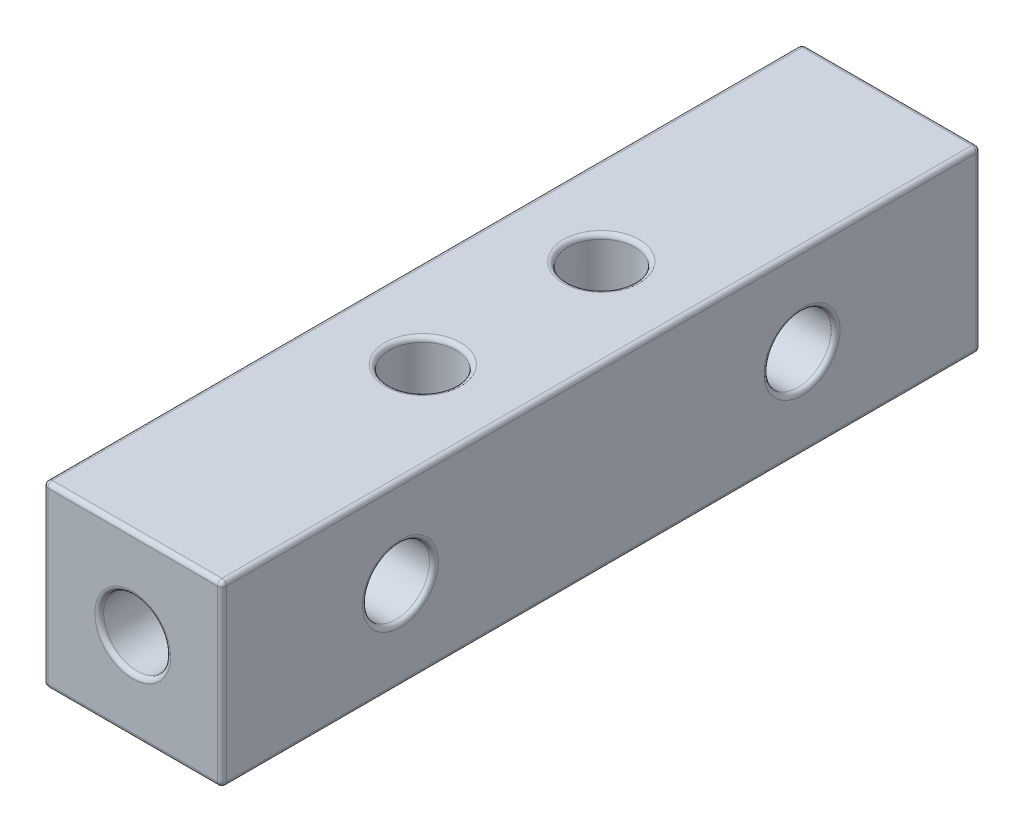
ISO-10303-21;
HEADER;
FILE_DESCRIPTION(('STEP AP214'),'2;1');
FILE_NAME('part.step','',(''),(''),'','','');
FILE_SCHEMA(('AUTOMOTIVE_DESIGN { 1 0 10303 214 1 1 1 1 }'));
ENDSEC;
DATA;
#1=APPLICATION_CONTEXT('core data for automotive mechanical design processes');
#2=APPLICATION_PROTOCOL_DEFINITION('international standard','automotive_design',2000,#1);
#3=PRODUCT_CONTEXT('',#1,'mechanical');
#4=PRODUCT('Part','Part','',(#3));
#5=PRODUCT_RELATED_PRODUCT_CATEGORY('part','',(#4));
#6=PRODUCT_DEFINITION_FORMATION('','',#4);
#7=PRODUCT_DEFINITION_CONTEXT('part definition',#1,'design');
#8=PRODUCT_DEFINITION('design','',#6,#7);
#9=PRODUCT_DEFINITION_SHAPE('','',#8);
#10=(LENGTH_UNIT() NAMED_UNIT(*) SI_UNIT(.MILLI.,.METRE.));
#11=(NAMED_UNIT(*) PLANE_ANGLE_UNIT() SI_UNIT($,.RADIAN.));
#12=(NAMED_UNIT(*) SI_UNIT($,.STERADIAN.) SOLID_ANGLE_UNIT());
#13=UNCERTAINTY_MEASURE_WITH_UNIT(LENGTH_MEASURE(1.E-05),#10,'distance_accuracy_value','');
#14=(GEOMETRIC_REPRESENTATION_CONTEXT(3) GLOBAL_UNCERTAINTY_ASSIGNED_CONTEXT((#13)) GLOBAL_UNIT_ASSIGNED_CONTEXT((#10,
#11,#12)) REPRESENTATION_CONTEXT('',''));
#15=CARTESIAN_POINT('',(0.,0.,0.));
#16=DIRECTION('',(0.,0.,1.));
#17=DIRECTION('',(1.,0.,0.));
#18=AXIS2_PLACEMENT_3D('',#15,#16,#17);
#19=CARTESIAN_POINT('',(0.,0.,24.));
#20=DIRECTION('',(0.,0.,1.));
#21=DIRECTION('',(1.,0.,0.));
#22=AXIS2_PLACEMENT_3D('',#19,#20,#21);
#23=CYLINDRICAL_SURFACE('',#22,1.5);
#24=CARTESIAN_POINT('',(0.,0.,33.8));
#25=DIRECTION('',(0.,0.,1.));
#26=DIRECTION('',(1.,0.,0.));
#27=AXIS2_PLACEMENT_3D('',#24,#25,#26);
#28=CIRCLE('',#27,1.5);
#29=CARTESIAN_POINT('',(1.5,0.,33.8));
#30=VERTEX_POINT('',#29);
#31=EDGE_CURVE('E304',#30,#30,#28,.T.);
#32=ORIENTED_EDGE('',*,*,#31,.T.);
#33=EDGE_LOOP('',(#32));
#34=FACE_BOUND('',#33,.T.);
#35=CARTESIAN_POINT('',(0.,0.,26.));
#36=DIRECTION('',(-0.707106781186547,0.,0.707106781186547));
#37=DIRECTION('',(0.707106781186547,0.,0.707106781186547));
#38=AXIS2_PLACEMENT_3D('',#35,#36,#37);
#39=ELLIPSE('',#38,2.12132034355964,1.5);
#40=CARTESIAN_POINT('',(0.,1.5,26.));
#41=VERTEX_POINT('',#40);
#42=CARTESIAN_POINT('',(0.,-1.5,26.));
#43=VERTEX_POINT('',#42);
#44=EDGE_CURVE('E138',#41,#43,#39,.F.);
#45=ORIENTED_EDGE('',*,*,#44,.T.);
#46=CARTESIAN_POINT('',(0.,0.,26.));
#47=DIRECTION('',(0.707106781186547,0.,0.707106781186547));
#48=DIRECTION('',(-0.707106781186547,0.,0.707106781186547));
#49=AXIS2_PLACEMENT_3D('',#46,#47,#48);
#50=ELLIPSE('',#49,2.12132034355964,1.5);
#51=EDGE_CURVE('E134',#43,#41,#50,.F.);
#52=ORIENTED_EDGE('',*,*,#51,.T.);
#53=EDGE_LOOP('',(#45,#52));
#54=FACE_BOUND('',#53,.T.);
#55=ADVANCED_FACE('F35',(#34,#54),#23,.F.);
#56=CARTESIAN_POINT('',(4.,4.,34.));
#57=DIRECTION('',(-1.,0.,0.));
#58=DIRECTION('',(0.,-1.,0.));
#59=AXIS2_PLACEMENT_3D('',#56,#57,#58);
#60=PLANE('',#59);
#61=CARTESIAN_POINT('',(4.,0.,8.));
#62=DIRECTION('',(-1.,0.,0.));
#63=DIRECTION('',(0.,-1.,0.));
#64=AXIS2_PLACEMENT_3D('',#61,#62,#63);
#65=CIRCLE('',#64,1.7);
#66=CARTESIAN_POINT('',(4.,-1.7,8.));
#67=VERTEX_POINT('',#66);
#68=EDGE_CURVE('E43',#67,#67,#65,.T.);
#69=ORIENTED_EDGE('',*,*,#68,.T.);
#70=EDGE_LOOP('',(#69));
#71=FACE_BOUND('',#70,.T.);
#72=CARTESIAN_POINT('',(4.,0.,26.));
#73=DIRECTION('',(-1.,0.,0.));
#74=DIRECTION('',(0.,-1.,0.));
#75=AXIS2_PLACEMENT_3D('',#72,#73,#74);
#76=CIRCLE('',#75,1.7);
#77=CARTESIAN_POINT('',(4.,-1.7,26.));
#78=VERTEX_POINT('',#77);
#79=EDGE_CURVE('E313',#78,#78,#76,.T.);
#80=ORIENTED_EDGE('',*,*,#79,.T.);
#81=EDGE_LOOP('',(#80));
#82=FACE_BOUND('',#81,.T.);
#83=DIRECTION('',(0.,0.,-1.));
#84=VECTOR('',#83,1.);
#85=CARTESIAN_POINT('',(4.,3.8,34.));
#86=LINE('',#85,#84);
#87=CARTESIAN_POINT('',(4.,3.8,0.199999999999999));
#88=VERTEX_POINT('',#87);
#89=CARTESIAN_POINT('',(4.,3.8,33.8));
#90=VERTEX_POINT('',#89);
#91=EDGE_CURVE('E173',#88,#90,#86,.F.);
#92=ORIENTED_EDGE('',*,*,#91,.T.);
#93=DIRECTION('',(0.,1.,0.));
#94=VECTOR('',#93,1.);
#95=CARTESIAN_POINT('',(4.,-4.,33.8));
#96=LINE('',#95,#94);
#97=CARTESIAN_POINT('',(4.,-3.8,33.8));
#98=VERTEX_POINT('',#97);
#99=EDGE_CURVE('E175',#90,#98,#96,.F.);
#100=ORIENTED_EDGE('',*,*,#99,.T.);
#101=DIRECTION('',(0.,0.,-1.));
#102=VECTOR('',#101,1.);
#103=CARTESIAN_POINT('',(4.,-3.8,34.));
#104=LINE('',#103,#102);
#105=CARTESIAN_POINT('',(4.,-3.8,0.199999999999999));
#106=VERTEX_POINT('',#105);
#107=EDGE_CURVE('E169',#98,#106,#104,.T.);
#108=ORIENTED_EDGE('',*,*,#107,.T.);
#109=DIRECTION('',(0.,1.,0.));
#110=VECTOR('',#109,1.);
#111=CARTESIAN_POINT('',(4.,4.,0.199999999999999));
#112=LINE('',#111,#110);
#113=EDGE_CURVE('E171',#106,#88,#112,.T.);
#114=ORIENTED_EDGE('',*,*,#113,.T.);
#115=EDGE_LOOP('',(#92,#100,#108,#114));
#116=FACE_BOUND('',#115,.T.);
#117=ADVANCED_FACE('F318',(#71,#82,#116),#60,.F.);
#118=CARTESIAN_POINT('',(-4.,4.,34.));
#119=DIRECTION('',(0.,-1.,0.));
#120=DIRECTION('',(0.,0.,-1.));
#121=AXIS2_PLACEMENT_3D('',#118,#119,#120);
#122=PLANE('',#121);
#123=CARTESIAN_POINT('',(0.,4.,21.));
#124=DIRECTION('',(0.,-1.,0.));
#125=DIRECTION('',(0.,0.,-1.));
#126=AXIS2_PLACEMENT_3D('',#123,#124,#125);
#127=CIRCLE('',#126,1.7);
#128=CARTESIAN_POINT('',(0.,4.,19.3));
#129=VERTEX_POINT('',#128);
#130=EDGE_CURVE('E298',#129,#129,#127,.T.);
#131=ORIENTED_EDGE('',*,*,#130,.T.);
#132=EDGE_LOOP('',(#131));
#133=FACE_BOUND('',#132,.T.);
#134=CARTESIAN_POINT('',(0.,4.,13.));
#135=DIRECTION('',(0.,-1.,0.));
#136=DIRECTION('',(0.,0.,-1.));
#137=AXIS2_PLACEMENT_3D('',#134,#135,#136);
#138=CIRCLE('',#137,1.7);
#139=CARTESIAN_POINT('',(0.,4.,11.3));
#140=VERTEX_POINT('',#139);
#141=EDGE_CURVE('E295',#140,#140,#138,.T.);
#142=ORIENTED_EDGE('',*,*,#141,.T.);
#143=EDGE_LOOP('',(#142));
#144=FACE_BOUND('',#143,.T.);
#145=DIRECTION('',(0.,0.,-1.));
#146=VECTOR('',#145,1.);
#147=CARTESIAN_POINT('',(-3.8,4.,34.));
#148=LINE('',#147,#146);
#149=CARTESIAN_POINT('',(-3.8,4.,0.199999999999999));
#150=VERTEX_POINT('',#149);
#151=CARTESIAN_POINT('',(-3.8,4.,33.8));
#152=VERTEX_POINT('',#151);
#153=EDGE_CURVE('E160',#150,#152,#148,.F.);
#154=ORIENTED_EDGE('',*,*,#153,.T.);
#155=DIRECTION('',(-1.,0.,0.));
#156=VECTOR('',#155,1.);
#157=CARTESIAN_POINT('',(4.,4.,33.8));
#158=LINE('',#157,#156);
#159=CARTESIAN_POINT('',(3.8,4.,33.8));
#160=VERTEX_POINT('',#159);
#161=EDGE_CURVE('E166',#152,#160,#158,.F.);
#162=ORIENTED_EDGE('',*,*,#161,.T.);
#163=DIRECTION('',(0.,0.,-1.));
#164=VECTOR('',#163,1.);
#165=CARTESIAN_POINT('',(3.8,4.,34.));
#166=LINE('',#165,#164);
#167=CARTESIAN_POINT('',(3.8,4.,0.199999999999999));
#168=VERTEX_POINT('',#167);
#169=EDGE_CURVE('E164',#160,#168,#166,.T.);
#170=ORIENTED_EDGE('',*,*,#169,.T.);
#171=DIRECTION('',(-1.,0.,0.));
#172=VECTOR('',#171,1.);
#173=CARTESIAN_POINT('',(-4.,4.,0.199999999999999));
#174=LINE('',#173,#172);
#175=EDGE_CURVE('E162',#168,#150,#174,.T.);
#176=ORIENTED_EDGE('',*,*,#175,.T.);
#177=EDGE_LOOP('',(#154,#162,#170,#176));
#178=FACE_BOUND('',#177,.T.);
#179=ADVANCED_FACE('F345',(#133,#144,#178),#122,.F.);
#180=CARTESIAN_POINT('',(-4.,4.,34.));
#181=DIRECTION('',(1.,0.,0.));
#182=DIRECTION('',(0.,1.,0.));
#183=AXIS2_PLACEMENT_3D('',#180,#181,#182);
#184=PLANE('',#183);
#185=DIRECTION('',(0.,-1.,0.));
#186=VECTOR('',#185,1.);
#187=CARTESIAN_POINT('',(-4.,4.,33.8));
#188=LINE('',#187,#186);
#189=CARTESIAN_POINT('',(-4.,-3.8,33.8));
#190=VERTEX_POINT('',#189);
#191=CARTESIAN_POINT('',(-4.,3.8,33.8));
#192=VERTEX_POINT('',#191);
#193=EDGE_CURVE('E50',#190,#192,#188,.F.);
#194=ORIENTED_EDGE('',*,*,#193,.T.);
#195=DIRECTION('',(0.,0.,-1.));
#196=VECTOR('',#195,1.);
#197=CARTESIAN_POINT('',(-4.,3.8,34.));
#198=LINE('',#197,#196);
#199=CARTESIAN_POINT('',(-4.,3.8,0.199999999999999));
#200=VERTEX_POINT('',#199);
#201=EDGE_CURVE('E218',#192,#200,#198,.T.);
#202=ORIENTED_EDGE('',*,*,#201,.T.);
#203=DIRECTION('',(0.,-1.,0.));
#204=VECTOR('',#203,1.);
#205=CARTESIAN_POINT('',(-4.,4.,0.199999999999999));
#206=LINE('',#205,#204);
#207=CARTESIAN_POINT('',(-4.,-3.8,0.199999999999999));
#208=VERTEX_POINT('',#207);
#209=EDGE_CURVE('E214',#200,#208,#206,.T.);
#210=ORIENTED_EDGE('',*,*,#209,.T.);
#211=DIRECTION('',(0.,0.,-1.));
#212=VECTOR('',#211,1.);
#213=CARTESIAN_POINT('',(-4.,-3.8,34.));
#214=LINE('',#213,#212);
#215=EDGE_CURVE('E55',#208,#190,#214,.F.);
#216=ORIENTED_EDGE('',*,*,#215,.T.);
#217=EDGE_LOOP('',(#194,#202,#210,#216));
#218=FACE_BOUND('',#217,.T.);
#219=CARTESIAN_POINT('',(-4.,0.,26.));
#220=DIRECTION('',(1.,0.,0.));
#221=DIRECTION('',(0.,1.,0.));
#222=AXIS2_PLACEMENT_3D('',#219,#220,#221);
#223=CIRCLE('',#222,1.7);
#224=CARTESIAN_POINT('',(-4.,1.7,26.));
#225=VERTEX_POINT('',#224);
#226=EDGE_CURVE('E211',#225,#225,#223,.T.);
#227=ORIENTED_EDGE('',*,*,#226,.T.);
#228=EDGE_LOOP('',(#227));
#229=FACE_BOUND('',#228,.T.);
#230=CARTESIAN_POINT('',(-4.,0.,8.));
#231=DIRECTION('',(1.,0.,0.));
#232=DIRECTION('',(0.,1.,0.));
#233=AXIS2_PLACEMENT_3D('',#230,#231,#232);
#234=CIRCLE('',#233,1.7);
#235=CARTESIAN_POINT('',(-4.,1.7,8.));
#236=VERTEX_POINT('',#235);
#237=EDGE_CURVE('E208',#236,#236,#234,.T.);
#238=ORIENTED_EDGE('',*,*,#237,.T.);
#239=EDGE_LOOP('',(#238));
#240=FACE_BOUND('',#239,.T.);
#241=ADVANCED_FACE('F342',(#218,#229,#240),#184,.F.);
#242=CARTESIAN_POINT('',(-4.,-4.,34.));
#243=DIRECTION('',(0.,1.,0.));
#244=DIRECTION('',(0.,0.,1.));
#245=AXIS2_PLACEMENT_3D('',#242,#243,#244);
#246=PLANE('',#245);
#247=CARTESIAN_POINT('',(0.,-4.,13.));
#248=DIRECTION('',(0.,1.,0.));
#249=DIRECTION('',(0.,0.,1.));
#250=AXIS2_PLACEMENT_3D('',#247,#248,#249);
#251=CIRCLE('',#250,1.7);
#252=CARTESIAN_POINT('',(0.,-4.,14.7));
#253=VERTEX_POINT('',#252);
#254=EDGE_CURVE('E199',#253,#253,#251,.T.);
#255=ORIENTED_EDGE('',*,*,#254,.T.);
#256=EDGE_LOOP('',(#255));
#257=FACE_BOUND('',#256,.T.);
#258=CARTESIAN_POINT('',(0.,-4.,21.));
#259=DIRECTION('',(0.,1.,0.));
#260=DIRECTION('',(0.,0.,1.));
#261=AXIS2_PLACEMENT_3D('',#258,#259,#260);
#262=CIRCLE('',#261,1.7);
#263=CARTESIAN_POINT('',(0.,-4.,22.7));
#264=VERTEX_POINT('',#263);
#265=EDGE_CURVE('E196',#264,#264,#262,.T.);
#266=ORIENTED_EDGE('',*,*,#265,.T.);
#267=EDGE_LOOP('',(#266));
#268=FACE_BOUND('',#267,.T.);
#269=DIRECTION('',(0.,0.,-1.));
#270=VECTOR('',#269,1.);
#271=CARTESIAN_POINT('',(3.8,-4.,34.));
#272=LINE('',#271,#270);
#273=CARTESIAN_POINT('',(3.8,-4.,0.199999999999999));
#274=VERTEX_POINT('',#273);
#275=CARTESIAN_POINT('',(3.8,-4.,33.8));
#276=VERTEX_POINT('',#275);
#277=EDGE_CURVE('E191',#274,#276,#272,.F.);
#278=ORIENTED_EDGE('',*,*,#277,.T.);
#279=DIRECTION('',(1.,0.,0.));
#280=VECTOR('',#279,1.);
#281=CARTESIAN_POINT('',(-4.,-4.,33.8));
#282=LINE('',#281,#280);
#283=CARTESIAN_POINT('',(-3.8,-4.,33.8));
#284=VERTEX_POINT('',#283);
#285=EDGE_CURVE('E193',#276,#284,#282,.F.);
#286=ORIENTED_EDGE('',*,*,#285,.T.);
#287=DIRECTION('',(0.,0.,-1.));
#288=VECTOR('',#287,1.);
#289=CARTESIAN_POINT('',(-3.8,-4.,34.));
#290=LINE('',#289,#288);
#291=CARTESIAN_POINT('',(-3.8,-4.,0.199999999999999));
#292=VERTEX_POINT('',#291);
#293=EDGE_CURVE('E187',#284,#292,#290,.T.);
#294=ORIENTED_EDGE('',*,*,#293,.T.);
#295=DIRECTION('',(1.,0.,0.));
#296=VECTOR('',#295,1.);
#297=CARTESIAN_POINT('',(-4.,-4.,0.199999999999999));
#298=LINE('',#297,#296);
#299=EDGE_CURVE('E189',#292,#274,#298,.T.);
#300=ORIENTED_EDGE('',*,*,#299,.T.);
#301=EDGE_LOOP('',(#278,#286,#294,#300));
#302=FACE_BOUND('',#301,.T.);
#303=ADVANCED_FACE('F344',(#257,#268,#302),#246,.F.);
#304=CARTESIAN_POINT('',(0.,0.,34.));
#305=DIRECTION('',(0.,0.,1.));
#306=DIRECTION('',(1.,0.,0.));
#307=AXIS2_PLACEMENT_3D('',#304,#305,#306);
#308=PLANE('',#307);
#309=CARTESIAN_POINT('',(0.,0.,34.));
#310=DIRECTION('',(0.,0.,1.));
#311=DIRECTION('',(1.,0.,0.));
#312=AXIS2_PLACEMENT_3D('',#309,#310,#311);
#313=CIRCLE('',#312,1.7);
#314=CARTESIAN_POINT('',(1.7,0.,34.));
#315=VERTEX_POINT('',#314);
#316=EDGE_CURVE('E307',#315,#315,#313,.F.);
#317=ORIENTED_EDGE('',*,*,#316,.T.);
#318=EDGE_LOOP('',(#317));
#319=FACE_BOUND('',#318,.T.);
#320=DIRECTION('',(0.,1.,0.));
#321=VECTOR('',#320,1.);
#322=CARTESIAN_POINT('',(3.8,4.,34.));
#323=LINE('',#322,#321);
#324=CARTESIAN_POINT('',(3.8,-3.8,34.));
#325=VERTEX_POINT('',#324);
#326=CARTESIAN_POINT('',(3.8,3.8,34.));
#327=VERTEX_POINT('',#326);
#328=EDGE_CURVE('E155',#325,#327,#323,.T.);
#329=ORIENTED_EDGE('',*,*,#328,.T.);
#330=DIRECTION('',(-1.,0.,0.));
#331=VECTOR('',#330,1.);
#332=CARTESIAN_POINT('',(-4.,3.8,34.));
#333=LINE('',#332,#331);
#334=CARTESIAN_POINT('',(-3.8,3.8,34.));
#335=VERTEX_POINT('',#334);
#336=EDGE_CURVE('E157',#327,#335,#333,.T.);
#337=ORIENTED_EDGE('',*,*,#336,.T.);
#338=DIRECTION('',(0.,-1.,0.));
#339=VECTOR('',#338,1.);
#340=CARTESIAN_POINT('',(-3.8,-4.,34.));
#341=LINE('',#340,#339);
#342=CARTESIAN_POINT('',(-3.8,-3.8,34.));
#343=VERTEX_POINT('',#342);
#344=EDGE_CURVE('E146',#335,#343,#341,.T.);
#345=ORIENTED_EDGE('',*,*,#344,.T.);
#346=DIRECTION('',(1.,0.,0.));
#347=VECTOR('',#346,1.);
#348=CARTESIAN_POINT('',(4.,-3.8,34.));
#349=LINE('',#348,#347);
#350=EDGE_CURVE('E153',#343,#325,#349,.T.);
#351=ORIENTED_EDGE('',*,*,#350,.T.);
#352=EDGE_LOOP('',(#329,#337,#345,#351));
#353=FACE_BOUND('',#352,.T.);
#354=ADVANCED_FACE('F351',(#319,#353),#308,.T.);
#355=CARTESIAN_POINT('',(0.,0.,0.));
#356=DIRECTION('',(0.,0.,1.));
#357=DIRECTION('',(1.,0.,0.));
#358=AXIS2_PLACEMENT_3D('',#355,#356,#357);
#359=PLANE('',#358);
#360=DIRECTION('',(0.,-1.,0.));
#361=VECTOR('',#360,1.);
#362=CARTESIAN_POINT('',(-3.8,0.,0.));
#363=LINE('',#362,#361);
#364=CARTESIAN_POINT('',(-3.8,-3.8,0.));
#365=VERTEX_POINT('',#364);
#366=CARTESIAN_POINT('',(-3.8,3.8,0.));
#367=VERTEX_POINT('',#366);
#368=EDGE_CURVE('E178',#365,#367,#363,.F.);
#369=ORIENTED_EDGE('',*,*,#368,.T.);
#370=DIRECTION('',(-1.,0.,0.));
#371=VECTOR('',#370,1.);
#372=CARTESIAN_POINT('',(0.,3.8,0.));
#373=LINE('',#372,#371);
#374=CARTESIAN_POINT('',(3.8,3.8,0.));
#375=VERTEX_POINT('',#374);
#376=EDGE_CURVE('E184',#367,#375,#373,.F.);
#377=ORIENTED_EDGE('',*,*,#376,.T.);
#378=DIRECTION('',(0.,1.,0.));
#379=VECTOR('',#378,1.);
#380=CARTESIAN_POINT('',(3.8,0.,0.));
#381=LINE('',#380,#379);
#382=CARTESIAN_POINT('',(3.8,-3.8,0.));
#383=VERTEX_POINT('',#382);
#384=EDGE_CURVE('E182',#375,#383,#381,.F.);
#385=ORIENTED_EDGE('',*,*,#384,.T.);
#386=DIRECTION('',(1.,0.,0.));
#387=VECTOR('',#386,1.);
#388=CARTESIAN_POINT('',(0.,-3.8,0.));
#389=LINE('',#388,#387);
#390=EDGE_CURVE('E180',#383,#365,#389,.F.);
#391=ORIENTED_EDGE('',*,*,#390,.T.);
#392=EDGE_LOOP('',(#369,#377,#385,#391));
#393=FACE_BOUND('',#392,.T.);
#394=ADVANCED_FACE('F385',(#393),#359,.F.);
#395=CARTESIAN_POINT('',(0.,-4.,13.));
#396=DIRECTION('',(0.,1.,0.));
#397=DIRECTION('',(0.,0.,1.));
#398=AXIS2_PLACEMENT_3D('',#395,#396,#397);
#399=CYLINDRICAL_SURFACE('',#398,1.5);
#400=CARTESIAN_POINT('',(0.,3.8,13.));
#401=DIRECTION('',(0.,-1.,0.));
#402=DIRECTION('',(0.,0.,-1.));
#403=AXIS2_PLACEMENT_3D('',#400,#401,#402);
#404=CIRCLE('',#403,1.5);
#405=CARTESIAN_POINT('',(0.,3.8,11.5));
#406=VERTEX_POINT('',#405);
#407=EDGE_CURVE('E301',#406,#406,#404,.F.);
#408=ORIENTED_EDGE('',*,*,#407,.T.);
#409=EDGE_LOOP('',(#408));
#410=FACE_BOUND('',#409,.T.);
#411=CARTESIAN_POINT('',(0.,-3.8,13.));
#412=DIRECTION('',(0.,1.,0.));
#413=DIRECTION('',(0.,0.,1.));
#414=AXIS2_PLACEMENT_3D('',#411,#412,#413);
#415=CIRCLE('',#414,1.5);
#416=CARTESIAN_POINT('',(0.,-3.8,14.5));
#417=VERTEX_POINT('',#416);
#418=EDGE_CURVE('E202',#417,#417,#415,.F.);
#419=ORIENTED_EDGE('',*,*,#418,.T.);
#420=EDGE_LOOP('',(#419));
#421=FACE_BOUND('',#420,.T.);
#422=ADVANCED_FACE('F382',(#410,#421),#399,.F.);
#423=CARTESIAN_POINT('',(0.,-4.,21.));
#424=DIRECTION('',(0.,1.,0.));
#425=DIRECTION('',(0.,0.,1.));
#426=AXIS2_PLACEMENT_3D('',#423,#424,#425);
#427=CYLINDRICAL_SURFACE('',#426,1.5);
#428=CARTESIAN_POINT('',(0.,3.8,21.));
#429=DIRECTION('',(0.,-1.,0.));
#430=DIRECTION('',(0.,0.,-1.));
#431=AXIS2_PLACEMENT_3D('',#428,#429,#430);
#432=CIRCLE('',#431,1.5);
#433=CARTESIAN_POINT('',(0.,3.8,19.5));
#434=VERTEX_POINT('',#433);
#435=EDGE_CURVE('E226',#434,#434,#432,.F.);
#436=ORIENTED_EDGE('',*,*,#435,.T.);
#437=EDGE_LOOP('',(#436));
#438=FACE_BOUND('',#437,.T.);
#439=CARTESIAN_POINT('',(0.,-3.8,21.));
#440=DIRECTION('',(0.,1.,0.));
#441=DIRECTION('',(0.,0.,1.));
#442=AXIS2_PLACEMENT_3D('',#439,#440,#441);
#443=CIRCLE('',#442,1.5);
#444=CARTESIAN_POINT('',(0.,-3.8,22.5));
#445=VERTEX_POINT('',#444);
#446=EDGE_CURVE('E205',#445,#445,#443,.F.);
#447=ORIENTED_EDGE('',*,*,#446,.T.);
#448=EDGE_LOOP('',(#447));
#449=FACE_BOUND('',#448,.T.);
#450=ADVANCED_FACE('F378',(#438,#449),#427,.F.);
#451=CARTESIAN_POINT('',(-4.,0.,26.));
#452=DIRECTION('',(1.,0.,0.));
#453=DIRECTION('',(0.,1.,0.));
#454=AXIS2_PLACEMENT_3D('',#451,#452,#453);
#455=CYLINDRICAL_SURFACE('',#454,1.5);
#456=CARTESIAN_POINT('',(3.8,0.,26.));
#457=DIRECTION('',(-1.,0.,0.));
#458=DIRECTION('',(0.,-1.,0.));
#459=AXIS2_PLACEMENT_3D('',#456,#457,#458);
#460=CIRCLE('',#459,1.5);
#461=CARTESIAN_POINT('',(3.8,-1.5,26.));
#462=VERTEX_POINT('',#461);
#463=EDGE_CURVE('E11',#462,#462,#460,.F.);
#464=ORIENTED_EDGE('',*,*,#463,.T.);
#465=EDGE_LOOP('',(#464));
#466=FACE_BOUND('',#465,.T.);
#467=ORIENTED_EDGE('',*,*,#44,.F.);
#468=CARTESIAN_POINT('',(0.,0.,26.));
#469=DIRECTION('',(0.707106781186547,0.,0.707106781186547));
#470=DIRECTION('',(-0.707106781186547,0.,0.707106781186547));
#471=AXIS2_PLACEMENT_3D('',#468,#469,#470);
#472=ELLIPSE('',#471,2.12132034355964,1.5);
#473=EDGE_CURVE('E137',#43,#41,#472,.T.);
#474=ORIENTED_EDGE('',*,*,#473,.F.);
#475=EDGE_LOOP('',(#467,#474));
#476=FACE_BOUND('',#475,.T.);
#477=ADVANCED_FACE('F142',(#466,#476),#455,.F.);
#478=CARTESIAN_POINT('',(0.,0.,24.));
#479=DIRECTION('',(0.,0.,1.));
#480=DIRECTION('',(1.,0.,0.));
#481=AXIS2_PLACEMENT_3D('',#478,#479,#480);
#482=PLANE('',#481);
#483=CARTESIAN_POINT('',(0.,0.,24.));
#484=DIRECTION('',(0.,0.,1.));
#485=DIRECTION('',(1.,0.,0.));
#486=AXIS2_PLACEMENT_3D('',#483,#484,#485);
#487=CIRCLE('',#486,1.5);
#488=CARTESIAN_POINT('',(1.5,0.,24.));
#489=VERTEX_POINT('',#488);
#490=EDGE_CURVE('E144',#489,#489,#487,.T.);
#491=ORIENTED_EDGE('',*,*,#490,.T.);
#492=EDGE_LOOP('',(#491));
#493=FACE_BOUND('',#492,.T.);
#494=ADVANCED_FACE('F367',(#493),#482,.T.);
#495=CARTESIAN_POINT('',(0.,0.,26.));
#496=DIRECTION('',(-0.707106781186547,0.,0.707106781186547));
#497=DIRECTION('',(0.707106781186547,0.,0.707106781186547));
#498=AXIS2_PLACEMENT_3D('',#495,#496,#497);
#499=ELLIPSE('',#498,2.12132034355964,1.5);
#500=EDGE_CURVE('E130',#41,#43,#499,.T.);
#501=ORIENTED_EDGE('',*,*,#500,.T.);
#502=ORIENTED_EDGE('',*,*,#473,.T.);
#503=EDGE_LOOP('',(#501,#502));
#504=FACE_BOUND('',#503,.T.);
#505=ORIENTED_EDGE('',*,*,#490,.F.);
#506=EDGE_LOOP('',(#505));
#507=FACE_BOUND('',#506,.T.);
#508=ADVANCED_FACE('F148',(#504,#507),#23,.F.);
#509=CARTESIAN_POINT('',(-3.8,0.,26.));
#510=DIRECTION('',(1.,0.,0.));
#511=DIRECTION('',(0.,1.,0.));
#512=AXIS2_PLACEMENT_3D('',#509,#510,#511);
#513=CIRCLE('',#512,1.5);
#514=CARTESIAN_POINT('',(-3.8,1.5,26.));
#515=VERTEX_POINT('',#514);
#516=EDGE_CURVE('E220',#515,#515,#513,.F.);
#517=ORIENTED_EDGE('',*,*,#516,.T.);
#518=EDGE_LOOP('',(#517));
#519=FACE_BOUND('',#518,.T.);
#520=ORIENTED_EDGE('',*,*,#500,.F.);
#521=ORIENTED_EDGE('',*,*,#51,.F.);
#522=EDGE_LOOP('',(#520,#521));
#523=FACE_BOUND('',#522,.T.);
#524=ADVANCED_FACE('F132',(#519,#523),#455,.F.);
#525=CARTESIAN_POINT('',(-4.,0.,8.));
#526=DIRECTION('',(1.,0.,0.));
#527=DIRECTION('',(0.,1.,0.));
#528=AXIS2_PLACEMENT_3D('',#525,#526,#527);
#529=CYLINDRICAL_SURFACE('',#528,1.5);
#530=CARTESIAN_POINT('',(3.8,0.,8.));
#531=DIRECTION('',(-1.,0.,0.));
#532=DIRECTION('',(0.,-1.,0.));
#533=AXIS2_PLACEMENT_3D('',#530,#531,#532);
#534=CIRCLE('',#533,1.5);
#535=CARTESIAN_POINT('',(3.8,-1.5,8.));
#536=VERTEX_POINT('',#535);
#537=EDGE_CURVE('E310',#536,#536,#534,.F.);
#538=ORIENTED_EDGE('',*,*,#537,.T.);
#539=EDGE_LOOP('',(#538));
#540=FACE_BOUND('',#539,.T.);
#541=CARTESIAN_POINT('',(-3.8,0.,8.));
#542=DIRECTION('',(1.,0.,0.));
#543=DIRECTION('',(0.,1.,0.));
#544=AXIS2_PLACEMENT_3D('',#541,#542,#543);
#545=CIRCLE('',#544,1.5);
#546=CARTESIAN_POINT('',(-3.8,1.5,8.));
#547=VERTEX_POINT('',#546);
#548=EDGE_CURVE('E223',#547,#547,#545,.F.);
#549=ORIENTED_EDGE('',*,*,#548,.T.);
#550=EDGE_LOOP('',(#549));
#551=FACE_BOUND('',#550,.T.);
#552=ADVANCED_FACE('F327',(#540,#551),#529,.F.);
#553=CARTESIAN_POINT('',(-4.,-3.8,0.199999999999999));
#554=DIRECTION('',(1.,0.,0.));
#555=DIRECTION('',(0.,0.,-1.));
#556=AXIS2_PLACEMENT_3D('',#553,#554,#555);
#557=CYLINDRICAL_SURFACE('',#556,0.2);
#558=CARTESIAN_POINT('',(3.8,-3.8,0.199999999999999));
#559=DIRECTION('',(1.,0.,0.));
#560=DIRECTION('',(0.,0.,-1.));
#561=AXIS2_PLACEMENT_3D('',#558,#559,#560);
#562=CIRCLE('',#561,0.2);
#563=EDGE_CURVE('E290',#274,#383,#562,.T.);
#564=ORIENTED_EDGE('',*,*,#563,.F.);
#565=ORIENTED_EDGE('',*,*,#299,.F.);
#566=CARTESIAN_POINT('',(-3.8,-3.8,0.2));
#567=DIRECTION('',(-1.,0.,0.));
#568=DIRECTION('',(0.,0.,1.));
#569=AXIS2_PLACEMENT_3D('',#566,#567,#568);
#570=CIRCLE('',#569,0.2);
#571=EDGE_CURVE('E287',#365,#292,#570,.T.);
#572=ORIENTED_EDGE('',*,*,#571,.F.);
#573=ORIENTED_EDGE('',*,*,#390,.F.);
#574=EDGE_LOOP('',(#564,#565,#572,#573));
#575=FACE_BOUND('',#574,.T.);
#576=ADVANCED_FACE('F330',(#575),#557,.T.);
#577=CARTESIAN_POINT('',(3.8,-3.8,0.2));
#578=DIRECTION('',(0.,0.,-1.));
#579=DIRECTION('',(-1.,0.,0.));
#580=AXIS2_PLACEMENT_3D('',#577,#578,#579);
#581=SPHERICAL_SURFACE('',#580,0.2);
#582=CARTESIAN_POINT('',(3.8,-3.8,0.199999999999999));
#583=DIRECTION('',(0.,0.,-1.));
#584=DIRECTION('',(-1.,0.,0.));
#585=AXIS2_PLACEMENT_3D('',#582,#583,#584);
#586=CIRCLE('',#585,0.2);
#587=EDGE_CURVE('E281',#274,#106,#586,.F.);
#588=ORIENTED_EDGE('',*,*,#587,.F.);
#589=ORIENTED_EDGE('',*,*,#563,.T.);
#590=CARTESIAN_POINT('',(3.8,-3.8,0.2));
#591=DIRECTION('',(0.,-1.,0.));
#592=DIRECTION('',(1.,0.,0.));
#593=AXIS2_PLACEMENT_3D('',#590,#591,#592);
#594=CIRCLE('',#593,0.2);
#595=EDGE_CURVE('E284',#106,#383,#594,.F.);
#596=ORIENTED_EDGE('',*,*,#595,.F.);
#597=EDGE_LOOP('',(#588,#589,#596));
#598=FACE_BOUND('',#597,.T.);
#599=ADVANCED_FACE('F473',(#598),#581,.T.);
#600=CARTESIAN_POINT('',(-3.8,-3.8,0.2));
#601=DIRECTION('',(0.,-1.,0.));
#602=DIRECTION('',(0.,0.,-1.));
#603=AXIS2_PLACEMENT_3D('',#600,#601,#602);
#604=SPHERICAL_SURFACE('',#603,0.2);
#605=CARTESIAN_POINT('',(-3.8,-3.8,0.199999999999999));
#606=DIRECTION('',(0.,-1.,0.));
#607=DIRECTION('',(0.,0.,-1.));
#608=AXIS2_PLACEMENT_3D('',#605,#606,#607);
#609=CIRCLE('',#608,0.2);
#610=EDGE_CURVE('E275',#365,#208,#609,.F.);
#611=ORIENTED_EDGE('',*,*,#610,.F.);
#612=ORIENTED_EDGE('',*,*,#571,.T.);
#613=CARTESIAN_POINT('',(-3.8,-3.8,0.199999999999999));
#614=DIRECTION('',(0.,0.,-1.));
#615=DIRECTION('',(-1.,0.,0.));
#616=AXIS2_PLACEMENT_3D('',#613,#614,#615);
#617=CIRCLE('',#616,0.2);
#618=EDGE_CURVE('E278',#208,#292,#617,.F.);
#619=ORIENTED_EDGE('',*,*,#618,.F.);
#620=EDGE_LOOP('',(#611,#612,#619));
#621=FACE_BOUND('',#620,.T.);
#622=ADVANCED_FACE('F464',(#621),#604,.T.);
#623=CARTESIAN_POINT('',(3.8,4.,0.199999999999999));
#624=DIRECTION('',(0.,1.,0.));
#625=DIRECTION('',(-1.,0.,0.));
#626=AXIS2_PLACEMENT_3D('',#623,#624,#625);
#627=CYLINDRICAL_SURFACE('',#626,0.2);
#628=ORIENTED_EDGE('',*,*,#595,.T.);
#629=ORIENTED_EDGE('',*,*,#384,.F.);
#630=CARTESIAN_POINT('',(3.8,3.8,0.199999999999999));
#631=DIRECTION('',(0.,1.,0.));
#632=DIRECTION('',(0.,0.,1.));
#633=AXIS2_PLACEMENT_3D('',#630,#631,#632);
#634=CIRCLE('',#633,0.2);
#635=EDGE_CURVE('E270',#88,#375,#634,.T.);
#636=ORIENTED_EDGE('',*,*,#635,.F.);
#637=ORIENTED_EDGE('',*,*,#113,.F.);
#638=EDGE_LOOP('',(#628,#629,#636,#637));
#639=FACE_BOUND('',#638,.T.);
#640=ADVANCED_FACE('F478',(#639),#627,.T.);
#641=CARTESIAN_POINT('',(3.8,-3.8,34.));
#642=DIRECTION('',(0.,0.,-1.));
#643=DIRECTION('',(-1.,0.,0.));
#644=AXIS2_PLACEMENT_3D('',#641,#642,#643);
#645=CYLINDRICAL_SURFACE('',#644,0.2);
#646=ORIENTED_EDGE('',*,*,#587,.T.);
#647=ORIENTED_EDGE('',*,*,#107,.F.);
#648=CARTESIAN_POINT('',(3.8,-3.8,33.8));
#649=DIRECTION('',(0.,0.,1.));
#650=DIRECTION('',(1.,0.,0.));
#651=AXIS2_PLACEMENT_3D('',#648,#649,#650);
#652=CIRCLE('',#651,0.2);
#653=EDGE_CURVE('E267',#276,#98,#652,.T.);
#654=ORIENTED_EDGE('',*,*,#653,.F.);
#655=ORIENTED_EDGE('',*,*,#277,.F.);
#656=EDGE_LOOP('',(#646,#647,#654,#655));
#657=FACE_BOUND('',#656,.T.);
#658=ADVANCED_FACE('F417',(#657),#645,.T.);
#659=CARTESIAN_POINT('',(0.,-3.8,33.8));
#660=DIRECTION('',(-1.,0.,0.));
#661=DIRECTION('',(0.,0.,1.));
#662=AXIS2_PLACEMENT_3D('',#659,#660,#661);
#663=CYLINDRICAL_SURFACE('',#662,0.2);
#664=CARTESIAN_POINT('',(-3.8,-3.8,33.8));
#665=DIRECTION('',(-1.,0.,0.));
#666=DIRECTION('',(0.,0.,1.));
#667=AXIS2_PLACEMENT_3D('',#664,#665,#666);
#668=CIRCLE('',#667,0.2);
#669=EDGE_CURVE('E261',#284,#343,#668,.T.);
#670=ORIENTED_EDGE('',*,*,#669,.F.);
#671=ORIENTED_EDGE('',*,*,#285,.F.);
#672=CARTESIAN_POINT('',(3.8,-3.8,33.8));
#673=DIRECTION('',(1.,0.,0.));
#674=DIRECTION('',(0.,0.,-1.));
#675=AXIS2_PLACEMENT_3D('',#672,#673,#674);
#676=CIRCLE('',#675,0.2);
#677=EDGE_CURVE('E264',#325,#276,#676,.T.);
#678=ORIENTED_EDGE('',*,*,#677,.F.);
#679=ORIENTED_EDGE('',*,*,#350,.F.);
#680=EDGE_LOOP('',(#670,#671,#678,#679));
#681=FACE_BOUND('',#680,.T.);
#682=ADVANCED_FACE('F412',(#681),#663,.T.);
#683=CARTESIAN_POINT('',(-3.8,-3.8,34.));
#684=DIRECTION('',(0.,0.,-1.));
#685=DIRECTION('',(-1.,0.,0.));
#686=AXIS2_PLACEMENT_3D('',#683,#684,#685);
#687=CYLINDRICAL_SURFACE('',#686,0.2);
#688=ORIENTED_EDGE('',*,*,#618,.T.);
#689=ORIENTED_EDGE('',*,*,#293,.F.);
#690=CARTESIAN_POINT('',(-3.8,-3.8,33.8));
#691=DIRECTION('',(0.,0.,1.));
#692=DIRECTION('',(1.,0.,0.));
#693=AXIS2_PLACEMENT_3D('',#690,#691,#692);
#694=CIRCLE('',#693,0.2);
#695=EDGE_CURVE('E259',#190,#284,#694,.T.);
#696=ORIENTED_EDGE('',*,*,#695,.F.);
#697=ORIENTED_EDGE('',*,*,#215,.F.);
#698=EDGE_LOOP('',(#688,#689,#696,#697));
#699=FACE_BOUND('',#698,.T.);
#700=ADVANCED_FACE('F467',(#699),#687,.T.);
#701=CARTESIAN_POINT('',(-3.8,4.,0.199999999999999));
#702=DIRECTION('',(0.,-1.,0.));
#703=DIRECTION('',(1.,0.,0.));
#704=AXIS2_PLACEMENT_3D('',#701,#702,#703);
#705=CYLINDRICAL_SURFACE('',#704,0.2);
#706=ORIENTED_EDGE('',*,*,#610,.T.);
#707=ORIENTED_EDGE('',*,*,#209,.F.);
#708=CARTESIAN_POINT('',(-3.8,3.8,0.2));
#709=DIRECTION('',(0.,1.,0.));
#710=DIRECTION('',(0.,0.,1.));
#711=AXIS2_PLACEMENT_3D('',#708,#709,#710);
#712=CIRCLE('',#711,0.2);
#713=EDGE_CURVE('E256',#367,#200,#712,.T.);
#714=ORIENTED_EDGE('',*,*,#713,.F.);
#715=ORIENTED_EDGE('',*,*,#368,.F.);
#716=EDGE_LOOP('',(#706,#707,#714,#715));
#717=FACE_BOUND('',#716,.T.);
#718=ADVANCED_FACE('F460',(#717),#705,.T.);
#719=CARTESIAN_POINT('',(-4.,3.8,0.199999999999999));
#720=DIRECTION('',(-1.,0.,0.));
#721=DIRECTION('',(0.,0.,1.));
#722=AXIS2_PLACEMENT_3D('',#719,#720,#721);
#723=CYLINDRICAL_SURFACE('',#722,0.2);
#724=CARTESIAN_POINT('',(3.8,3.8,0.2));
#725=DIRECTION('',(1.,0.,0.));
#726=DIRECTION('',(0.,1.,0.));
#727=AXIS2_PLACEMENT_3D('',#724,#725,#726);
#728=CIRCLE('',#727,0.2);
#729=EDGE_CURVE('E272',#375,#168,#728,.T.);
#730=ORIENTED_EDGE('',*,*,#729,.F.);
#731=ORIENTED_EDGE('',*,*,#376,.F.);
#732=CARTESIAN_POINT('',(-3.8,3.8,0.199999999999999));
#733=DIRECTION('',(-1.,0.,0.));
#734=DIRECTION('',(0.,0.,1.));
#735=AXIS2_PLACEMENT_3D('',#732,#733,#734);
#736=CIRCLE('',#735,0.2);
#737=EDGE_CURVE('E253',#150,#367,#736,.T.);
#738=ORIENTED_EDGE('',*,*,#737,.F.);
#739=ORIENTED_EDGE('',*,*,#175,.F.);
#740=EDGE_LOOP('',(#730,#731,#738,#739));
#741=FACE_BOUND('',#740,.T.);
#742=ADVANCED_FACE('F453',(#741),#723,.T.);
#743=CARTESIAN_POINT('',(3.8,3.8,0.2));
#744=DIRECTION('',(0.,0.,-1.));
#745=DIRECTION('',(-1.,0.,0.));
#746=AXIS2_PLACEMENT_3D('',#743,#744,#745);
#747=SPHERICAL_SURFACE('',#746,0.2);
#748=ORIENTED_EDGE('',*,*,#635,.T.);
#749=ORIENTED_EDGE('',*,*,#729,.T.);
#750=CARTESIAN_POINT('',(3.8,3.8,0.199999999999999));
#751=DIRECTION('',(0.,0.,-1.));
#752=DIRECTION('',(-1.,0.,0.));
#753=AXIS2_PLACEMENT_3D('',#750,#751,#752);
#754=CIRCLE('',#753,0.2);
#755=EDGE_CURVE('E250',#88,#168,#754,.F.);
#756=ORIENTED_EDGE('',*,*,#755,.F.);
#757=EDGE_LOOP('',(#748,#749,#756));
#758=FACE_BOUND('',#757,.T.);
#759=ADVANCED_FACE('F509',(#758),#747,.T.);
#760=CARTESIAN_POINT('',(3.8,-3.8,33.8));
#761=DIRECTION('',(0.,-1.,0.));
#762=DIRECTION('',(0.,0.,-1.));
#763=AXIS2_PLACEMENT_3D('',#760,#761,#762);
#764=SPHERICAL_SURFACE('',#763,0.2);
#765=ORIENTED_EDGE('',*,*,#677,.T.);
#766=ORIENTED_EDGE('',*,*,#653,.T.);
#767=CARTESIAN_POINT('',(3.8,-3.8,33.8));
#768=DIRECTION('',(0.,-1.,0.));
#769=DIRECTION('',(0.,0.,-1.));
#770=AXIS2_PLACEMENT_3D('',#767,#768,#769);
#771=CIRCLE('',#770,0.2);
#772=EDGE_CURVE('E248',#325,#98,#771,.F.);
#773=ORIENTED_EDGE('',*,*,#772,.F.);
#774=EDGE_LOOP('',(#765,#766,#773));
#775=FACE_BOUND('',#774,.T.);
#776=ADVANCED_FACE('F419',(#775),#764,.T.);
#777=CARTESIAN_POINT('',(-3.8,-3.8,33.8));
#778=DIRECTION('',(0.,-1.,0.));
#779=DIRECTION('',(0.,0.,-1.));
#780=AXIS2_PLACEMENT_3D('',#777,#778,#779);
#781=SPHERICAL_SURFACE('',#780,0.2);
#782=ORIENTED_EDGE('',*,*,#695,.T.);
#783=ORIENTED_EDGE('',*,*,#669,.T.);
#784=CARTESIAN_POINT('',(-3.8,-3.8,33.8));
#785=DIRECTION('',(0.,-1.,0.));
#786=DIRECTION('',(0.,0.,-1.));
#787=AXIS2_PLACEMENT_3D('',#784,#785,#786);
#788=CIRCLE('',#787,0.2);
#789=EDGE_CURVE('E245',#190,#343,#788,.F.);
#790=ORIENTED_EDGE('',*,*,#789,.F.);
#791=EDGE_LOOP('',(#782,#783,#790));
#792=FACE_BOUND('',#791,.T.);
#793=ADVANCED_FACE('F431',(#792),#781,.T.);
#794=CARTESIAN_POINT('',(-3.8,3.8,0.2));
#795=DIRECTION('',(0.,0.,-1.));
#796=DIRECTION('',(-1.,0.,0.));
#797=AXIS2_PLACEMENT_3D('',#794,#795,#796);
#798=SPHERICAL_SURFACE('',#797,0.2);
#799=ORIENTED_EDGE('',*,*,#737,.T.);
#800=ORIENTED_EDGE('',*,*,#713,.T.);
#801=CARTESIAN_POINT('',(-3.8,3.8,0.199999999999999));
#802=DIRECTION('',(0.,0.,-1.));
#803=DIRECTION('',(-1.,0.,0.));
#804=AXIS2_PLACEMENT_3D('',#801,#802,#803);
#805=CIRCLE('',#804,0.2);
#806=EDGE_CURVE('E243',#150,#200,#805,.F.);
#807=ORIENTED_EDGE('',*,*,#806,.F.);
#808=EDGE_LOOP('',(#799,#800,#807));
#809=FACE_BOUND('',#808,.T.);
#810=ADVANCED_FACE('F456',(#809),#798,.T.);
#811=CARTESIAN_POINT('',(3.8,3.8,34.));
#812=DIRECTION('',(0.,0.,-1.));
#813=DIRECTION('',(-1.,0.,0.));
#814=AXIS2_PLACEMENT_3D('',#811,#812,#813);
#815=CYLINDRICAL_SURFACE('',#814,0.2);
#816=ORIENTED_EDGE('',*,*,#755,.T.);
#817=ORIENTED_EDGE('',*,*,#169,.F.);
#818=CARTESIAN_POINT('',(3.8,3.8,33.8));
#819=DIRECTION('',(0.,0.,1.));
#820=DIRECTION('',(1.,0.,0.));
#821=AXIS2_PLACEMENT_3D('',#818,#819,#820);
#822=CIRCLE('',#821,0.2);
#823=EDGE_CURVE('E240',#90,#160,#822,.T.);
#824=ORIENTED_EDGE('',*,*,#823,.F.);
#825=ORIENTED_EDGE('',*,*,#91,.F.);
#826=EDGE_LOOP('',(#816,#817,#824,#825));
#827=FACE_BOUND('',#826,.T.);
#828=ADVANCED_FACE('F484',(#827),#815,.T.);
#829=CARTESIAN_POINT('',(3.8,0.,33.8));
#830=DIRECTION('',(0.,-1.,0.));
#831=DIRECTION('',(1.,0.,0.));
#832=AXIS2_PLACEMENT_3D('',#829,#830,#831);
#833=CYLINDRICAL_SURFACE('',#832,0.2);
#834=ORIENTED_EDGE('',*,*,#772,.T.);
#835=ORIENTED_EDGE('',*,*,#99,.F.);
#836=CARTESIAN_POINT('',(3.8,3.8,33.8));
#837=DIRECTION('',(0.,1.,0.));
#838=DIRECTION('',(0.,0.,1.));
#839=AXIS2_PLACEMENT_3D('',#836,#837,#838);
#840=CIRCLE('',#839,0.2);
#841=EDGE_CURVE('E237',#327,#90,#840,.T.);
#842=ORIENTED_EDGE('',*,*,#841,.F.);
#843=ORIENTED_EDGE('',*,*,#328,.F.);
#844=EDGE_LOOP('',(#834,#835,#842,#843));
#845=FACE_BOUND('',#844,.T.);
#846=ADVANCED_FACE('F424',(#845),#833,.T.);
#847=CARTESIAN_POINT('',(-3.8,0.,33.8));
#848=DIRECTION('',(0.,1.,0.));
#849=DIRECTION('',(-1.,0.,0.));
#850=AXIS2_PLACEMENT_3D('',#847,#848,#849);
#851=CYLINDRICAL_SURFACE('',#850,0.2);
#852=ORIENTED_EDGE('',*,*,#789,.T.);
#853=ORIENTED_EDGE('',*,*,#344,.F.);
#854=CARTESIAN_POINT('',(-3.8,3.8,33.8));
#855=DIRECTION('',(0.,1.,0.));
#856=DIRECTION('',(0.,0.,1.));
#857=AXIS2_PLACEMENT_3D('',#854,#855,#856);
#858=CIRCLE('',#857,0.2);
#859=EDGE_CURVE('E234',#192,#335,#858,.T.);
#860=ORIENTED_EDGE('',*,*,#859,.F.);
#861=ORIENTED_EDGE('',*,*,#193,.F.);
#862=EDGE_LOOP('',(#852,#853,#860,#861));
#863=FACE_BOUND('',#862,.T.);
#864=ADVANCED_FACE('F433',(#863),#851,.T.);
#865=CARTESIAN_POINT('',(-3.8,3.8,34.));
#866=DIRECTION('',(0.,0.,-1.));
#867=DIRECTION('',(-1.,0.,0.));
#868=AXIS2_PLACEMENT_3D('',#865,#866,#867);
#869=CYLINDRICAL_SURFACE('',#868,0.2);
#870=ORIENTED_EDGE('',*,*,#806,.T.);
#871=ORIENTED_EDGE('',*,*,#201,.F.);
#872=CARTESIAN_POINT('',(-3.8,3.8,33.8));
#873=DIRECTION('',(0.,0.,1.));
#874=DIRECTION('',(1.,0.,0.));
#875=AXIS2_PLACEMENT_3D('',#872,#873,#874);
#876=CIRCLE('',#875,0.2);
#877=EDGE_CURVE('E231',#152,#192,#876,.T.);
#878=ORIENTED_EDGE('',*,*,#877,.F.);
#879=ORIENTED_EDGE('',*,*,#153,.F.);
#880=EDGE_LOOP('',(#870,#871,#878,#879));
#881=FACE_BOUND('',#880,.T.);
#882=ADVANCED_FACE('F442',(#881),#869,.T.);
#883=CARTESIAN_POINT('',(3.8,3.8,33.8));
#884=DIRECTION('',(1.,0.,0.));
#885=DIRECTION('',(0.,0.,-1.));
#886=AXIS2_PLACEMENT_3D('',#883,#884,#885);
#887=SPHERICAL_SURFACE('',#886,0.2);
#888=ORIENTED_EDGE('',*,*,#841,.T.);
#889=ORIENTED_EDGE('',*,*,#823,.T.);
#890=CARTESIAN_POINT('',(3.8,3.8,33.8));
#891=DIRECTION('',(1.,0.,0.));
#892=DIRECTION('',(0.,0.,-1.));
#893=AXIS2_PLACEMENT_3D('',#890,#891,#892);
#894=CIRCLE('',#893,0.2);
#895=EDGE_CURVE('E229',#327,#160,#894,.F.);
#896=ORIENTED_EDGE('',*,*,#895,.F.);
#897=EDGE_LOOP('',(#888,#889,#896));
#898=FACE_BOUND('',#897,.T.);
#899=ADVANCED_FACE('F486',(#898),#887,.T.);
#900=CARTESIAN_POINT('',(-3.8,3.8,33.8));
#901=DIRECTION('',(-1.,0.,0.));
#902=DIRECTION('',(0.,0.,1.));
#903=AXIS2_PLACEMENT_3D('',#900,#901,#902);
#904=SPHERICAL_SURFACE('',#903,0.2);
#905=ORIENTED_EDGE('',*,*,#877,.T.);
#906=ORIENTED_EDGE('',*,*,#859,.T.);
#907=CARTESIAN_POINT('',(-3.8,3.8,33.8));
#908=DIRECTION('',(-1.,0.,0.));
#909=DIRECTION('',(0.,0.,1.));
#910=AXIS2_PLACEMENT_3D('',#907,#908,#909);
#911=CIRCLE('',#910,0.2);
#912=EDGE_CURVE('E227',#152,#335,#911,.F.);
#913=ORIENTED_EDGE('',*,*,#912,.F.);
#914=EDGE_LOOP('',(#905,#906,#913));
#915=FACE_BOUND('',#914,.T.);
#916=ADVANCED_FACE('F438',(#915),#904,.T.);
#917=CARTESIAN_POINT('',(0.,3.8,33.8));
#918=DIRECTION('',(1.,0.,0.));
#919=DIRECTION('',(0.,0.,-1.));
#920=AXIS2_PLACEMENT_3D('',#917,#918,#919);
#921=CYLINDRICAL_SURFACE('',#920,0.2);
#922=ORIENTED_EDGE('',*,*,#895,.T.);
#923=ORIENTED_EDGE('',*,*,#161,.F.);
#924=ORIENTED_EDGE('',*,*,#912,.T.);
#925=ORIENTED_EDGE('',*,*,#336,.F.);
#926=EDGE_LOOP('',(#922,#923,#924,#925));
#927=FACE_BOUND('',#926,.T.);
#928=ADVANCED_FACE('F444',(#927),#921,.T.);
#929=CARTESIAN_POINT('',(0.,-3.8,13.));
#930=DIRECTION('',(0.,1.,0.));
#931=DIRECTION('',(0.,0.,1.));
#932=AXIS2_PLACEMENT_3D('',#929,#930,#931);
#933=TOROIDAL_SURFACE('',#932,1.7,0.2);
#934=ORIENTED_EDGE('',*,*,#418,.F.);
#935=EDGE_LOOP('',(#934));
#936=FACE_BOUND('',#935,.T.);
#937=ORIENTED_EDGE('',*,*,#254,.F.);
#938=EDGE_LOOP('',(#937));
#939=FACE_BOUND('',#938,.T.);
#940=ADVANCED_FACE('F398',(#936,#939),#933,.T.);
#941=CARTESIAN_POINT('',(0.,-3.8,21.));
#942=DIRECTION('',(0.,1.,0.));
#943=DIRECTION('',(0.,0.,1.));
#944=AXIS2_PLACEMENT_3D('',#941,#942,#943);
#945=TOROIDAL_SURFACE('',#944,1.7,0.2);
#946=ORIENTED_EDGE('',*,*,#446,.F.);
#947=EDGE_LOOP('',(#946));
#948=FACE_BOUND('',#947,.T.);
#949=ORIENTED_EDGE('',*,*,#265,.F.);
#950=EDGE_LOOP('',(#949));
#951=FACE_BOUND('',#950,.T.);
#952=ADVANCED_FACE('F395',(#948,#951),#945,.T.);
#953=CARTESIAN_POINT('',(-3.8,0.,26.));
#954=DIRECTION('',(1.,0.,0.));
#955=DIRECTION('',(0.,1.,0.));
#956=AXIS2_PLACEMENT_3D('',#953,#954,#955);
#957=TOROIDAL_SURFACE('',#956,1.7,0.2);
#958=ORIENTED_EDGE('',*,*,#516,.F.);
#959=EDGE_LOOP('',(#958));
#960=FACE_BOUND('',#959,.T.);
#961=ORIENTED_EDGE('',*,*,#226,.F.);
#962=EDGE_LOOP('',(#961));
#963=FACE_BOUND('',#962,.T.);
#964=ADVANCED_FACE('F338',(#960,#963),#957,.T.);
#965=CARTESIAN_POINT('',(-3.8,0.,8.));
#966=DIRECTION('',(1.,0.,0.));
#967=DIRECTION('',(0.,1.,0.));
#968=AXIS2_PLACEMENT_3D('',#965,#966,#967);
#969=TOROIDAL_SURFACE('',#968,1.7,0.2);
#970=ORIENTED_EDGE('',*,*,#548,.F.);
#971=EDGE_LOOP('',(#970));
#972=FACE_BOUND('',#971,.T.);
#973=ORIENTED_EDGE('',*,*,#237,.F.);
#974=EDGE_LOOP('',(#973));
#975=FACE_BOUND('',#974,.T.);
#976=ADVANCED_FACE('F334',(#972,#975),#969,.T.);
#977=CARTESIAN_POINT('',(0.,3.8,21.));
#978=DIRECTION('',(0.,-1.,0.));
#979=DIRECTION('',(0.,0.,-1.));
#980=AXIS2_PLACEMENT_3D('',#977,#978,#979);
#981=TOROIDAL_SURFACE('',#980,1.7,0.2);
#982=ORIENTED_EDGE('',*,*,#130,.F.);
#983=EDGE_LOOP('',(#982));
#984=FACE_BOUND('',#983,.T.);
#985=ORIENTED_EDGE('',*,*,#435,.F.);
#986=EDGE_LOOP('',(#985));
#987=FACE_BOUND('',#986,.T.);
#988=ADVANCED_FACE('F337',(#984,#987),#981,.T.);
#989=CARTESIAN_POINT('',(0.,3.8,13.));
#990=DIRECTION('',(0.,-1.,0.));
#991=DIRECTION('',(0.,0.,-1.));
#992=AXIS2_PLACEMENT_3D('',#989,#990,#991);
#993=TOROIDAL_SURFACE('',#992,1.7,0.2);
#994=ORIENTED_EDGE('',*,*,#141,.F.);
#995=EDGE_LOOP('',(#994));
#996=FACE_BOUND('',#995,.T.);
#997=ORIENTED_EDGE('',*,*,#407,.F.);
#998=EDGE_LOOP('',(#997));
#999=FACE_BOUND('',#998,.T.);
#1000=ADVANCED_FACE('F539',(#996,#999),#993,.T.);
#1001=CARTESIAN_POINT('',(0.,0.,33.8));
#1002=DIRECTION('',(0.,0.,1.));
#1003=DIRECTION('',(1.,0.,0.));
#1004=AXIS2_PLACEMENT_3D('',#1001,#1002,#1003);
#1005=TOROIDAL_SURFACE('',#1004,1.7,0.2);
#1006=ORIENTED_EDGE('',*,*,#316,.F.);
#1007=EDGE_LOOP('',(#1006));
#1008=FACE_BOUND('',#1007,.T.);
#1009=ORIENTED_EDGE('',*,*,#31,.F.);
#1010=EDGE_LOOP('',(#1009));
#1011=FACE_BOUND('',#1010,.T.);
#1012=ADVANCED_FACE('F324',(#1008,#1011),#1005,.T.);
#1013=CARTESIAN_POINT('',(3.8,0.,8.));
#1014=DIRECTION('',(-1.,0.,0.));
#1015=DIRECTION('',(0.,-1.,0.));
#1016=AXIS2_PLACEMENT_3D('',#1013,#1014,#1015);
#1017=TOROIDAL_SURFACE('',#1016,1.7,0.2);
#1018=ORIENTED_EDGE('',*,*,#68,.F.);
#1019=EDGE_LOOP('',(#1018));
#1020=FACE_BOUND('',#1019,.T.);
#1021=ORIENTED_EDGE('',*,*,#537,.F.);
#1022=EDGE_LOOP('',(#1021));
#1023=FACE_BOUND('',#1022,.T.);
#1024=ADVANCED_FACE('F321',(#1020,#1023),#1017,.T.);
#1025=CARTESIAN_POINT('',(3.8,0.,26.));
#1026=DIRECTION('',(-1.,0.,0.));
#1027=DIRECTION('',(0.,-1.,0.));
#1028=AXIS2_PLACEMENT_3D('',#1025,#1026,#1027);
#1029=TOROIDAL_SURFACE('',#1028,1.7,0.2);
#1030=ORIENTED_EDGE('',*,*,#79,.F.);
#1031=EDGE_LOOP('',(#1030));
#1032=FACE_BOUND('',#1031,.T.);
#1033=ORIENTED_EDGE('',*,*,#463,.F.);
#1034=EDGE_LOOP('',(#1033));
#1035=FACE_BOUND('',#1034,.T.);
#1036=ADVANCED_FACE('F37',(#1032,#1035),#1029,.T.);
#1037=CLOSED_SHELL('',(#55,#117,#179,#241,#303,#354,#394,#422,#450,#477,#494,#508,#524,#552,
#576,#599,#622,#640,#658,#682,#700,#718,#742,#759,#776,#793,#810,#828,#846,#864,#882,#899,#916,
#928,#940,#952,#964,#976,#988,#1000,#1012,#1024,#1036));
#1038=MANIFOLD_SOLID_BREP('B2',#1037);
#1039=ADVANCED_BREP_SHAPE_REPRESENTATION('',(#18,#1038),#14);
#1040=SHAPE_DEFINITION_REPRESENTATION(#9,#1039);
ENDSEC;
END-ISO-10303-21;
